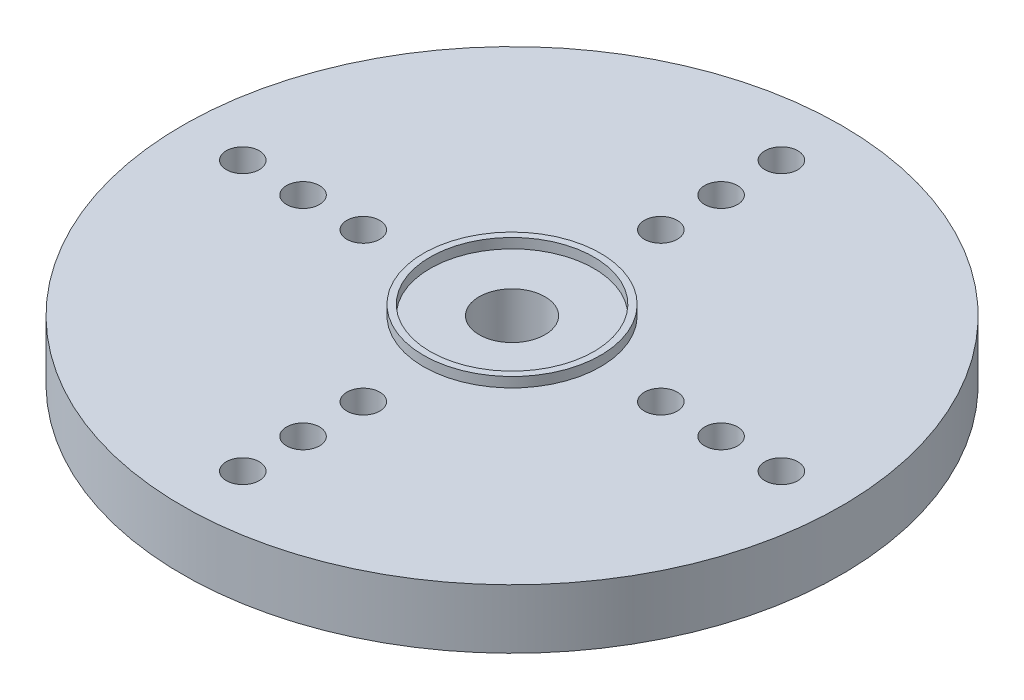
ISO-10303-21;
HEADER;
FILE_DESCRIPTION(('STEP AP214'),'2;1');
FILE_NAME('part.step','',(''),(''),'','','');
FILE_SCHEMA(('AUTOMOTIVE_DESIGN { 1 0 10303 214 1 1 1 1 }'));
ENDSEC;
DATA;
#1=APPLICATION_CONTEXT('core data for automotive mechanical design processes');
#2=APPLICATION_PROTOCOL_DEFINITION('international standard','automotive_design',2000,#1);
#3=PRODUCT_CONTEXT('',#1,'mechanical');
#4=PRODUCT('Part','Part','',(#3));
#5=PRODUCT_RELATED_PRODUCT_CATEGORY('part','',(#4));
#6=PRODUCT_DEFINITION_FORMATION('','',#4);
#7=PRODUCT_DEFINITION_CONTEXT('part definition',#1,'design');
#8=PRODUCT_DEFINITION('design','',#6,#7);
#9=PRODUCT_DEFINITION_SHAPE('','',#8);
#10=(LENGTH_UNIT() NAMED_UNIT(*) SI_UNIT(.MILLI.,.METRE.));
#11=(NAMED_UNIT(*) PLANE_ANGLE_UNIT() SI_UNIT($,.RADIAN.));
#12=(NAMED_UNIT(*) SI_UNIT($,.STERADIAN.) SOLID_ANGLE_UNIT());
#13=UNCERTAINTY_MEASURE_WITH_UNIT(LENGTH_MEASURE(1.E-05),#10,'distance_accuracy_value','');
#14=(GEOMETRIC_REPRESENTATION_CONTEXT(3) GLOBAL_UNCERTAINTY_ASSIGNED_CONTEXT((#13)) GLOBAL_UNIT_ASSIGNED_CONTEXT((#10,
#11,#12)) REPRESENTATION_CONTEXT('',''));
#15=CARTESIAN_POINT('',(0.,0.,0.));
#16=DIRECTION('',(0.,0.,1.));
#17=DIRECTION('',(1.,0.,0.));
#18=AXIS2_PLACEMENT_3D('',#15,#16,#17);
#19=CARTESIAN_POINT('',(1.,4.06,0.));
#20=DIRECTION('',(0.,1.,0.));
#21=DIRECTION('',(0.,0.,1.));
#22=AXIS2_PLACEMENT_3D('',#19,#20,#21);
#23=PLANE('',#22);
#24=CARTESIAN_POINT('',(0.,4.06,0.));
#25=DIRECTION('',(0.,-1.,0.));
#26=DIRECTION('',(0.,0.,-1.));
#27=AXIS2_PLACEMENT_3D('',#24,#25,#26);
#28=CIRCLE('',#27,1.);
#29=CARTESIAN_POINT('',(0.,4.06,-1.));
#30=VERTEX_POINT('',#29);
#31=EDGE_CURVE('E127',#30,#30,#28,.T.);
#32=ORIENTED_EDGE('',*,*,#31,.T.);
#33=EDGE_LOOP('',(#32));
#34=FACE_BOUND('',#33,.T.);
#35=CARTESIAN_POINT('',(0.,4.06,0.));
#36=DIRECTION('',(0.,1.,0.));
#37=DIRECTION('',(0.,0.,1.));
#38=AXIS2_PLACEMENT_3D('',#35,#36,#37);
#39=CIRCLE('',#38,2.485);
#40=CARTESIAN_POINT('',(0.,4.06,2.485));
#41=VERTEX_POINT('',#40);
#42=EDGE_CURVE('E10',#41,#41,#39,.F.);
#43=ORIENTED_EDGE('',*,*,#42,.F.);
#44=EDGE_LOOP('',(#43));
#45=FACE_BOUND('',#44,.T.);
#46=ADVANCED_FACE('F41',(#34,#45),#23,.T.);
#47=CARTESIAN_POINT('',(6.3425,4.06,0.));
#48=DIRECTION('',(0.,1.,0.));
#49=DIRECTION('',(0.,0.,1.));
#50=AXIS2_PLACEMENT_3D('',#47,#48,#49);
#51=CIRCLE('',#50,0.500000000000001);
#52=CARTESIAN_POINT('',(6.3425,4.06,0.500000000000023));
#53=VERTEX_POINT('',#52);
#54=EDGE_CURVE('E62',#53,#53,#51,.F.);
#55=ORIENTED_EDGE('',*,*,#54,.T.);
#56=EDGE_LOOP('',(#55));
#57=FACE_BOUND('',#56,.T.);
#58=CARTESIAN_POINT('',(8.17125,4.06,0.));
#59=DIRECTION('',(0.,1.,0.));
#60=DIRECTION('',(0.,0.,1.));
#61=AXIS2_PLACEMENT_3D('',#58,#59,#60);
#62=CIRCLE('',#61,0.500000000000001);
#63=CARTESIAN_POINT('',(8.17125,4.06,0.50000000000003));
#64=VERTEX_POINT('',#63);
#65=EDGE_CURVE('E100',#64,#64,#62,.F.);
#66=ORIENTED_EDGE('',*,*,#65,.T.);
#67=EDGE_LOOP('',(#66));
#68=FACE_BOUND('',#67,.T.);
#69=CARTESIAN_POINT('',(0.,4.06,4.51375));
#70=DIRECTION('',(0.,1.,0.));
#71=DIRECTION('',(0.,0.,1.));
#72=AXIS2_PLACEMENT_3D('',#69,#70,#71);
#73=CIRCLE('',#72,0.500000000000001);
#74=CARTESIAN_POINT('',(0.,4.06,5.01375));
#75=VERTEX_POINT('',#74);
#76=EDGE_CURVE('E97',#75,#75,#73,.F.);
#77=ORIENTED_EDGE('',*,*,#76,.T.);
#78=EDGE_LOOP('',(#77));
#79=FACE_BOUND('',#78,.T.);
#80=CARTESIAN_POINT('',(0.,4.06,6.3425));
#81=DIRECTION('',(0.,1.,0.));
#82=DIRECTION('',(0.,0.,1.));
#83=AXIS2_PLACEMENT_3D('',#80,#81,#82);
#84=CIRCLE('',#83,0.500000000000001);
#85=CARTESIAN_POINT('',(0.,4.06,6.8425));
#86=VERTEX_POINT('',#85);
#87=EDGE_CURVE('E94',#86,#86,#84,.F.);
#88=ORIENTED_EDGE('',*,*,#87,.T.);
#89=EDGE_LOOP('',(#88));
#90=FACE_BOUND('',#89,.T.);
#91=CARTESIAN_POINT('',(0.,4.06,8.17125));
#92=DIRECTION('',(0.,1.,0.));
#93=DIRECTION('',(0.,0.,1.));
#94=AXIS2_PLACEMENT_3D('',#91,#92,#93);
#95=CIRCLE('',#94,0.500000000000001);
#96=CARTESIAN_POINT('',(0.,4.06,8.67125));
#97=VERTEX_POINT('',#96);
#98=EDGE_CURVE('E90',#97,#97,#95,.F.);
#99=ORIENTED_EDGE('',*,*,#98,.T.);
#100=EDGE_LOOP('',(#99));
#101=FACE_BOUND('',#100,.T.);
#102=CARTESIAN_POINT('',(-4.51375,4.06,0.));
#103=DIRECTION('',(0.,1.,0.));
#104=DIRECTION('',(0.,0.,1.));
#105=AXIS2_PLACEMENT_3D('',#102,#103,#104);
#106=CIRCLE('',#105,0.500000000000001);
#107=CARTESIAN_POINT('',(-4.51375,4.06,0.499999999999953));
#108=VERTEX_POINT('',#107);
#109=EDGE_CURVE('E86',#108,#108,#106,.F.);
#110=ORIENTED_EDGE('',*,*,#109,.T.);
#111=EDGE_LOOP('',(#110));
#112=FACE_BOUND('',#111,.T.);
#113=CARTESIAN_POINT('',(-6.3425,4.06,0.));
#114=DIRECTION('',(0.,1.,0.));
#115=DIRECTION('',(0.,0.,1.));
#116=AXIS2_PLACEMENT_3D('',#113,#114,#115);
#117=CIRCLE('',#116,0.500000000000001);
#118=CARTESIAN_POINT('',(-6.3425,4.06,0.499999999999934));
#119=VERTEX_POINT('',#118);
#120=EDGE_CURVE('E82',#119,#119,#117,.F.);
#121=ORIENTED_EDGE('',*,*,#120,.T.);
#122=EDGE_LOOP('',(#121));
#123=FACE_BOUND('',#122,.T.);
#124=CARTESIAN_POINT('',(-8.17125,4.06,0.));
#125=DIRECTION('',(0.,1.,0.));
#126=DIRECTION('',(0.,0.,1.));
#127=AXIS2_PLACEMENT_3D('',#124,#125,#126);
#128=CIRCLE('',#127,0.500000000000001);
#129=CARTESIAN_POINT('',(-8.17125,4.06,0.499999999999915));
#130=VERTEX_POINT('',#129);
#131=EDGE_CURVE('E78',#130,#130,#128,.F.);
#132=ORIENTED_EDGE('',*,*,#131,.T.);
#133=EDGE_LOOP('',(#132));
#134=FACE_BOUND('',#133,.T.);
#135=CARTESIAN_POINT('',(4.51375,4.06,0.));
#136=DIRECTION('',(0.,1.,0.));
#137=DIRECTION('',(0.,0.,1.));
#138=AXIS2_PLACEMENT_3D('',#135,#136,#137);
#139=CIRCLE('',#138,0.500000000000001);
#140=CARTESIAN_POINT('',(4.51375,4.06,0.500000000000016));
#141=VERTEX_POINT('',#140);
#142=EDGE_CURVE('E74',#141,#141,#139,.F.);
#143=ORIENTED_EDGE('',*,*,#142,.T.);
#144=EDGE_LOOP('',(#143));
#145=FACE_BOUND('',#144,.T.);
#146=CARTESIAN_POINT('',(0.,4.06,-4.51375));
#147=DIRECTION('',(0.,1.,0.));
#148=DIRECTION('',(0.,0.,1.));
#149=AXIS2_PLACEMENT_3D('',#146,#147,#148);
#150=CIRCLE('',#149,0.500000000000001);
#151=CARTESIAN_POINT('',(0.,4.06,-4.01375));
#152=VERTEX_POINT('',#151);
#153=EDGE_CURVE('E70',#152,#152,#150,.F.);
#154=ORIENTED_EDGE('',*,*,#153,.T.);
#155=EDGE_LOOP('',(#154));
#156=FACE_BOUND('',#155,.T.);
#157=CARTESIAN_POINT('',(0.,4.06,-6.3425));
#158=DIRECTION('',(0.,1.,0.));
#159=DIRECTION('',(0.,0.,1.));
#160=AXIS2_PLACEMENT_3D('',#157,#158,#159);
#161=CIRCLE('',#160,0.500000000000001);
#162=CARTESIAN_POINT('',(0.,4.06,-5.8425));
#163=VERTEX_POINT('',#162);
#164=EDGE_CURVE('E66',#163,#163,#161,.F.);
#165=ORIENTED_EDGE('',*,*,#164,.T.);
#166=EDGE_LOOP('',(#165));
#167=FACE_BOUND('',#166,.T.);
#168=CARTESIAN_POINT('',(0.,4.06,-8.17125));
#169=DIRECTION('',(0.,1.,0.));
#170=DIRECTION('',(0.,0.,1.));
#171=AXIS2_PLACEMENT_3D('',#168,#169,#170);
#172=CIRCLE('',#171,0.500000000000001);
#173=CARTESIAN_POINT('',(0.,4.06,-7.67125));
#174=VERTEX_POINT('',#173);
#175=EDGE_CURVE('E61',#174,#174,#172,.F.);
#176=ORIENTED_EDGE('',*,*,#175,.T.);
#177=EDGE_LOOP('',(#176));
#178=FACE_BOUND('',#177,.T.);
#179=CARTESIAN_POINT('',(0.,4.06,0.));
#180=DIRECTION('',(0.,1.,0.));
#181=DIRECTION('',(0.,0.,1.));
#182=AXIS2_PLACEMENT_3D('',#179,#180,#181);
#183=CIRCLE('',#182,2.685);
#184=CARTESIAN_POINT('',(0.,4.06,2.685));
#185=VERTEX_POINT('',#184);
#186=EDGE_CURVE('E123',#185,#185,#183,.T.);
#187=ORIENTED_EDGE('',*,*,#186,.F.);
#188=EDGE_LOOP('',(#187));
#189=FACE_BOUND('',#188,.T.);
#190=CARTESIAN_POINT('',(0.,4.06,0.));
#191=DIRECTION('',(0.,-1.,0.));
#192=DIRECTION('',(0.,0.,-1.));
#193=AXIS2_PLACEMENT_3D('',#190,#191,#192);
#194=CIRCLE('',#193,10.);
#195=CARTESIAN_POINT('',(0.,4.06,-10.));
#196=VERTEX_POINT('',#195);
#197=EDGE_CURVE('E49',#196,#196,#194,.T.);
#198=ORIENTED_EDGE('',*,*,#197,.F.);
#199=EDGE_LOOP('',(#198));
#200=FACE_BOUND('',#199,.T.);
#201=ADVANCED_FACE('F43',(#57,#68,#79,#90,#101,#112,#123,#134,#145,#156,#167,#178,#189,#200),
#23,.T.);
#202=CARTESIAN_POINT('',(0.,0.,0.));
#203=DIRECTION('',(0.,-1.,0.));
#204=DIRECTION('',(0.,0.,-1.));
#205=AXIS2_PLACEMENT_3D('',#202,#203,#204);
#206=CYLINDRICAL_SURFACE('',#205,10.);
#207=ORIENTED_EDGE('',*,*,#197,.T.);
#208=EDGE_LOOP('',(#207));
#209=FACE_BOUND('',#208,.T.);
#210=CARTESIAN_POINT('',(0.,2.26,0.));
#211=DIRECTION('',(0.,-1.,0.));
#212=DIRECTION('',(0.,0.,-1.));
#213=AXIS2_PLACEMENT_3D('',#210,#211,#212);
#214=CIRCLE('',#213,10.);
#215=CARTESIAN_POINT('',(0.,2.26,-10.));
#216=VERTEX_POINT('',#215);
#217=EDGE_CURVE('E54',#216,#216,#214,.T.);
#218=ORIENTED_EDGE('',*,*,#217,.F.);
#219=EDGE_LOOP('',(#218));
#220=FACE_BOUND('',#219,.T.);
#221=ADVANCED_FACE('F152',(#209,#220),#206,.T.);
#222=CARTESIAN_POINT('',(10.,2.26,0.));
#223=DIRECTION('',(0.,-1.,0.));
#224=DIRECTION('',(0.,0.,-1.));
#225=AXIS2_PLACEMENT_3D('',#222,#223,#224);
#226=PLANE('',#225);
#227=CARTESIAN_POINT('',(6.3425,2.26,0.));
#228=DIRECTION('',(0.,-1.,0.));
#229=DIRECTION('',(0.,0.,-1.));
#230=AXIS2_PLACEMENT_3D('',#227,#228,#229);
#231=CIRCLE('',#230,0.500000000000001);
#232=CARTESIAN_POINT('',(6.3425,2.26,-0.499999999999979));
#233=VERTEX_POINT('',#232);
#234=EDGE_CURVE('E45',#233,#233,#231,.F.);
#235=ORIENTED_EDGE('',*,*,#234,.T.);
#236=EDGE_LOOP('',(#235));
#237=FACE_BOUND('',#236,.T.);
#238=CARTESIAN_POINT('',(8.17125,2.26,0.));
#239=DIRECTION('',(0.,-1.,0.));
#240=DIRECTION('',(0.,0.,-1.));
#241=AXIS2_PLACEMENT_3D('',#238,#239,#240);
#242=CIRCLE('',#241,0.500000000000001);
#243=CARTESIAN_POINT('',(8.17125,2.26,-0.499999999999972));
#244=VERTEX_POINT('',#243);
#245=EDGE_CURVE('E98',#244,#244,#242,.F.);
#246=ORIENTED_EDGE('',*,*,#245,.T.);
#247=EDGE_LOOP('',(#246));
#248=FACE_BOUND('',#247,.T.);
#249=CARTESIAN_POINT('',(0.,2.26,4.51375));
#250=DIRECTION('',(0.,-1.,0.));
#251=DIRECTION('',(0.,0.,-1.));
#252=AXIS2_PLACEMENT_3D('',#249,#250,#251);
#253=CIRCLE('',#252,0.500000000000001);
#254=CARTESIAN_POINT('',(0.,2.26,4.01375));
#255=VERTEX_POINT('',#254);
#256=EDGE_CURVE('E95',#255,#255,#253,.F.);
#257=ORIENTED_EDGE('',*,*,#256,.T.);
#258=EDGE_LOOP('',(#257));
#259=FACE_BOUND('',#258,.T.);
#260=CARTESIAN_POINT('',(0.,2.26,6.3425));
#261=DIRECTION('',(0.,-1.,0.));
#262=DIRECTION('',(0.,0.,-1.));
#263=AXIS2_PLACEMENT_3D('',#260,#261,#262);
#264=CIRCLE('',#263,0.500000000000001);
#265=CARTESIAN_POINT('',(0.,2.26,5.8425));
#266=VERTEX_POINT('',#265);
#267=EDGE_CURVE('E91',#266,#266,#264,.F.);
#268=ORIENTED_EDGE('',*,*,#267,.T.);
#269=EDGE_LOOP('',(#268));
#270=FACE_BOUND('',#269,.T.);
#271=CARTESIAN_POINT('',(0.,2.26,8.17125));
#272=DIRECTION('',(0.,-1.,0.));
#273=DIRECTION('',(0.,0.,-1.));
#274=AXIS2_PLACEMENT_3D('',#271,#272,#273);
#275=CIRCLE('',#274,0.500000000000001);
#276=CARTESIAN_POINT('',(0.,2.26,7.67125));
#277=VERTEX_POINT('',#276);
#278=EDGE_CURVE('E87',#277,#277,#275,.F.);
#279=ORIENTED_EDGE('',*,*,#278,.T.);
#280=EDGE_LOOP('',(#279));
#281=FACE_BOUND('',#280,.T.);
#282=CARTESIAN_POINT('',(-4.51375,2.26,0.));
#283=DIRECTION('',(0.,-1.,0.));
#284=DIRECTION('',(0.,0.,-1.));
#285=AXIS2_PLACEMENT_3D('',#282,#283,#284);
#286=CIRCLE('',#285,0.500000000000001);
#287=CARTESIAN_POINT('',(-4.51375,2.26,-0.500000000000048));
#288=VERTEX_POINT('',#287);
#289=EDGE_CURVE('E83',#288,#288,#286,.F.);
#290=ORIENTED_EDGE('',*,*,#289,.T.);
#291=EDGE_LOOP('',(#290));
#292=FACE_BOUND('',#291,.T.);
#293=CARTESIAN_POINT('',(-6.3425,2.26,0.));
#294=DIRECTION('',(0.,-1.,0.));
#295=DIRECTION('',(0.,0.,-1.));
#296=AXIS2_PLACEMENT_3D('',#293,#294,#295);
#297=CIRCLE('',#296,0.500000000000001);
#298=CARTESIAN_POINT('',(-6.3425,2.26,-0.500000000000067));
#299=VERTEX_POINT('',#298);
#300=EDGE_CURVE('E79',#299,#299,#297,.F.);
#301=ORIENTED_EDGE('',*,*,#300,.T.);
#302=EDGE_LOOP('',(#301));
#303=FACE_BOUND('',#302,.T.);
#304=CARTESIAN_POINT('',(-8.17125,2.26,0.));
#305=DIRECTION('',(0.,-1.,0.));
#306=DIRECTION('',(0.,0.,-1.));
#307=AXIS2_PLACEMENT_3D('',#304,#305,#306);
#308=CIRCLE('',#307,0.500000000000001);
#309=CARTESIAN_POINT('',(-8.17125,2.26,-0.500000000000086));
#310=VERTEX_POINT('',#309);
#311=EDGE_CURVE('E75',#310,#310,#308,.F.);
#312=ORIENTED_EDGE('',*,*,#311,.T.);
#313=EDGE_LOOP('',(#312));
#314=FACE_BOUND('',#313,.T.);
#315=CARTESIAN_POINT('',(4.51375,2.26,0.));
#316=DIRECTION('',(0.,-1.,0.));
#317=DIRECTION('',(0.,0.,-1.));
#318=AXIS2_PLACEMENT_3D('',#315,#316,#317);
#319=CIRCLE('',#318,0.500000000000001);
#320=CARTESIAN_POINT('',(4.51375,2.26,-0.499999999999985));
#321=VERTEX_POINT('',#320);
#322=EDGE_CURVE('E71',#321,#321,#319,.F.);
#323=ORIENTED_EDGE('',*,*,#322,.T.);
#324=EDGE_LOOP('',(#323));
#325=FACE_BOUND('',#324,.T.);
#326=CARTESIAN_POINT('',(0.,2.26,-4.51375));
#327=DIRECTION('',(0.,-1.,0.));
#328=DIRECTION('',(0.,0.,-1.));
#329=AXIS2_PLACEMENT_3D('',#326,#327,#328);
#330=CIRCLE('',#329,0.500000000000001);
#331=CARTESIAN_POINT('',(0.,2.26,-5.01375));
#332=VERTEX_POINT('',#331);
#333=EDGE_CURVE('E67',#332,#332,#330,.F.);
#334=ORIENTED_EDGE('',*,*,#333,.T.);
#335=EDGE_LOOP('',(#334));
#336=FACE_BOUND('',#335,.T.);
#337=CARTESIAN_POINT('',(0.,2.26,-6.3425));
#338=DIRECTION('',(0.,-1.,0.));
#339=DIRECTION('',(0.,0.,-1.));
#340=AXIS2_PLACEMENT_3D('',#337,#338,#339);
#341=CIRCLE('',#340,0.500000000000001);
#342=CARTESIAN_POINT('',(0.,2.26,-6.8425));
#343=VERTEX_POINT('',#342);
#344=EDGE_CURVE('E63',#343,#343,#341,.F.);
#345=ORIENTED_EDGE('',*,*,#344,.T.);
#346=EDGE_LOOP('',(#345));
#347=FACE_BOUND('',#346,.T.);
#348=CARTESIAN_POINT('',(0.,2.26,-8.17125));
#349=DIRECTION('',(0.,-1.,0.));
#350=DIRECTION('',(0.,0.,-1.));
#351=AXIS2_PLACEMENT_3D('',#348,#349,#350);
#352=CIRCLE('',#351,0.500000000000001);
#353=CARTESIAN_POINT('',(0.,2.26,-8.67125));
#354=VERTEX_POINT('',#353);
#355=EDGE_CURVE('E58',#354,#354,#352,.F.);
#356=ORIENTED_EDGE('',*,*,#355,.T.);
#357=EDGE_LOOP('',(#356));
#358=FACE_BOUND('',#357,.T.);
#359=ORIENTED_EDGE('',*,*,#217,.T.);
#360=EDGE_LOOP('',(#359));
#361=FACE_BOUND('',#360,.T.);
#362=CARTESIAN_POINT('',(0.,2.26,0.));
#363=DIRECTION('',(0.,-1.,0.));
#364=DIRECTION('',(0.,0.,-1.));
#365=AXIS2_PLACEMENT_3D('',#362,#363,#364);
#366=CIRCLE('',#365,3.5);
#367=CARTESIAN_POINT('',(0.,2.26,-3.5));
#368=VERTEX_POINT('',#367);
#369=EDGE_CURVE('E144',#368,#368,#366,.T.);
#370=ORIENTED_EDGE('',*,*,#369,.F.);
#371=EDGE_LOOP('',(#370));
#372=FACE_BOUND('',#371,.T.);
#373=ADVANCED_FACE('F149',(#237,#248,#259,#270,#281,#292,#303,#314,#325,#336,#347,#358,#361,
#372),#226,.T.);
#374=CARTESIAN_POINT('',(0.,0.,0.));
#375=DIRECTION('',(0.,-1.,0.));
#376=DIRECTION('',(0.,0.,-1.));
#377=AXIS2_PLACEMENT_3D('',#374,#375,#376);
#378=CYLINDRICAL_SURFACE('',#377,3.5);
#379=ORIENTED_EDGE('',*,*,#369,.T.);
#380=EDGE_LOOP('',(#379));
#381=FACE_BOUND('',#380,.T.);
#382=CARTESIAN_POINT('',(0.,0.,0.));
#383=DIRECTION('',(0.,-1.,0.));
#384=DIRECTION('',(0.,0.,-1.));
#385=AXIS2_PLACEMENT_3D('',#382,#383,#384);
#386=CIRCLE('',#385,3.5);
#387=CARTESIAN_POINT('',(0.,0.,-3.5));
#388=VERTEX_POINT('',#387);
#389=EDGE_CURVE('E141',#388,#388,#386,.T.);
#390=ORIENTED_EDGE('',*,*,#389,.F.);
#391=EDGE_LOOP('',(#390));
#392=FACE_BOUND('',#391,.T.);
#393=ADVANCED_FACE('F159',(#381,#392),#378,.T.);
#394=CARTESIAN_POINT('',(3.5,0.,0.));
#395=DIRECTION('',(0.,-1.,0.));
#396=DIRECTION('',(0.,0.,-1.));
#397=AXIS2_PLACEMENT_3D('',#394,#395,#396);
#398=PLANE('',#397);
#399=ORIENTED_EDGE('',*,*,#389,.T.);
#400=EDGE_LOOP('',(#399));
#401=FACE_BOUND('',#400,.T.);
#402=CARTESIAN_POINT('',(0.,0.,0.));
#403=DIRECTION('',(0.,-1.,0.));
#404=DIRECTION('',(0.,0.,-1.));
#405=AXIS2_PLACEMENT_3D('',#402,#403,#404);
#406=CIRCLE('',#405,2.435);
#407=CARTESIAN_POINT('',(0.,0.,-2.435));
#408=VERTEX_POINT('',#407);
#409=EDGE_CURVE('E138',#408,#408,#406,.T.);
#410=ORIENTED_EDGE('',*,*,#409,.F.);
#411=EDGE_LOOP('',(#410));
#412=FACE_BOUND('',#411,.T.);
#413=ADVANCED_FACE('F191',(#401,#412),#398,.T.);
#414=CARTESIAN_POINT('',(0.,0.,0.));
#415=DIRECTION('',(0.,-1.,0.));
#416=DIRECTION('',(0.,0.,-1.));
#417=AXIS2_PLACEMENT_3D('',#414,#415,#416);
#418=CYLINDRICAL_SURFACE('',#417,2.435);
#419=ORIENTED_EDGE('',*,*,#409,.T.);
#420=EDGE_LOOP('',(#419));
#421=FACE_BOUND('',#420,.T.);
#422=CARTESIAN_POINT('',(0.,2.26,0.));
#423=DIRECTION('',(0.,-1.,0.));
#424=DIRECTION('',(0.,0.,-1.));
#425=AXIS2_PLACEMENT_3D('',#422,#423,#424);
#426=CIRCLE('',#425,2.435);
#427=CARTESIAN_POINT('',(0.,2.26,-2.435));
#428=VERTEX_POINT('',#427);
#429=EDGE_CURVE('E135',#428,#428,#426,.T.);
#430=ORIENTED_EDGE('',*,*,#429,.F.);
#431=EDGE_LOOP('',(#430));
#432=FACE_BOUND('',#431,.T.);
#433=ADVANCED_FACE('F184',(#421,#432),#418,.F.);
#434=CARTESIAN_POINT('',(1.,2.26,0.));
#435=DIRECTION('',(0.,-1.,0.));
#436=DIRECTION('',(0.,0.,-1.));
#437=AXIS2_PLACEMENT_3D('',#434,#435,#436);
#438=PLANE('',#437);
#439=ORIENTED_EDGE('',*,*,#429,.T.);
#440=EDGE_LOOP('',(#439));
#441=FACE_BOUND('',#440,.T.);
#442=CARTESIAN_POINT('',(0.,2.26,0.));
#443=DIRECTION('',(0.,-1.,0.));
#444=DIRECTION('',(0.,0.,-1.));
#445=AXIS2_PLACEMENT_3D('',#442,#443,#444);
#446=CIRCLE('',#445,1.);
#447=CARTESIAN_POINT('',(0.,2.26,-1.));
#448=VERTEX_POINT('',#447);
#449=EDGE_CURVE('E132',#448,#448,#446,.T.);
#450=ORIENTED_EDGE('',*,*,#449,.F.);
#451=EDGE_LOOP('',(#450));
#452=FACE_BOUND('',#451,.T.);
#453=ADVANCED_FACE('F175',(#441,#452),#438,.T.);
#454=CARTESIAN_POINT('',(0.,0.,0.));
#455=DIRECTION('',(0.,-1.,0.));
#456=DIRECTION('',(0.,0.,-1.));
#457=AXIS2_PLACEMENT_3D('',#454,#455,#456);
#458=CYLINDRICAL_SURFACE('',#457,1.);
#459=ORIENTED_EDGE('',*,*,#449,.T.);
#460=EDGE_LOOP('',(#459));
#461=FACE_BOUND('',#460,.T.);
#462=ORIENTED_EDGE('',*,*,#31,.F.);
#463=EDGE_LOOP('',(#462));
#464=FACE_BOUND('',#463,.T.);
#465=ADVANCED_FACE('F173',(#461,#464),#458,.F.);
#466=CARTESIAN_POINT('',(0.,4.36,0.));
#467=DIRECTION('',(0.,1.,0.));
#468=DIRECTION('',(0.,0.,1.));
#469=AXIS2_PLACEMENT_3D('',#466,#467,#468);
#470=PLANE('',#469);
#471=CARTESIAN_POINT('',(0.,4.36,0.));
#472=DIRECTION('',(0.,1.,0.));
#473=DIRECTION('',(0.,0.,1.));
#474=AXIS2_PLACEMENT_3D('',#471,#472,#473);
#475=CIRCLE('',#474,2.685);
#476=CARTESIAN_POINT('',(0.,4.36,2.685));
#477=VERTEX_POINT('',#476);
#478=EDGE_CURVE('E124',#477,#477,#475,.T.);
#479=ORIENTED_EDGE('',*,*,#478,.T.);
#480=EDGE_LOOP('',(#479));
#481=FACE_BOUND('',#480,.T.);
#482=CARTESIAN_POINT('',(0.,4.36,0.));
#483=DIRECTION('',(0.,1.,0.));
#484=DIRECTION('',(0.,0.,1.));
#485=AXIS2_PLACEMENT_3D('',#482,#483,#484);
#486=CIRCLE('',#485,2.485);
#487=CARTESIAN_POINT('',(0.,4.36,2.485));
#488=VERTEX_POINT('',#487);
#489=EDGE_CURVE('E120',#488,#488,#486,.T.);
#490=ORIENTED_EDGE('',*,*,#489,.F.);
#491=EDGE_LOOP('',(#490));
#492=FACE_BOUND('',#491,.T.);
#493=ADVANCED_FACE('F174',(#481,#492),#470,.T.);
#494=CARTESIAN_POINT('',(0.,4.36,0.));
#495=DIRECTION('',(0.,-1.,0.));
#496=DIRECTION('',(0.,0.,-1.));
#497=AXIS2_PLACEMENT_3D('',#494,#495,#496);
#498=CYLINDRICAL_SURFACE('',#497,2.685);
#499=ORIENTED_EDGE('',*,*,#478,.F.);
#500=EDGE_LOOP('',(#499));
#501=FACE_BOUND('',#500,.T.);
#502=ORIENTED_EDGE('',*,*,#186,.T.);
#503=EDGE_LOOP('',(#502));
#504=FACE_BOUND('',#503,.T.);
#505=ADVANCED_FACE('F181',(#501,#504),#498,.T.);
#506=CARTESIAN_POINT('',(0.,4.36,0.));
#507=DIRECTION('',(0.,-1.,0.));
#508=DIRECTION('',(0.,0.,-1.));
#509=AXIS2_PLACEMENT_3D('',#506,#507,#508);
#510=CYLINDRICAL_SURFACE('',#509,2.485);
#511=ORIENTED_EDGE('',*,*,#489,.T.);
#512=EDGE_LOOP('',(#511));
#513=FACE_BOUND('',#512,.T.);
#514=ORIENTED_EDGE('',*,*,#42,.T.);
#515=EDGE_LOOP('',(#514));
#516=FACE_BOUND('',#515,.T.);
#517=ADVANCED_FACE('F248',(#513,#516),#510,.F.);
#518=CARTESIAN_POINT('',(0.,4.36,-8.17125));
#519=DIRECTION('',(0.,-1.,0.));
#520=DIRECTION('',(0.,0.,-1.));
#521=AXIS2_PLACEMENT_3D('',#518,#519,#520);
#522=CYLINDRICAL_SURFACE('',#521,0.500000000000001);
#523=ORIENTED_EDGE('',*,*,#175,.F.);
#524=EDGE_LOOP('',(#523));
#525=FACE_BOUND('',#524,.T.);
#526=ORIENTED_EDGE('',*,*,#355,.F.);
#527=EDGE_LOOP('',(#526));
#528=FACE_BOUND('',#527,.T.);
#529=ADVANCED_FACE('F257',(#525,#528),#522,.F.);
#530=CARTESIAN_POINT('',(0.,4.36,-6.3425));
#531=DIRECTION('',(0.,-1.,0.));
#532=DIRECTION('',(0.,0.,-1.));
#533=AXIS2_PLACEMENT_3D('',#530,#531,#532);
#534=CYLINDRICAL_SURFACE('',#533,0.500000000000001);
#535=ORIENTED_EDGE('',*,*,#164,.F.);
#536=EDGE_LOOP('',(#535));
#537=FACE_BOUND('',#536,.T.);
#538=ORIENTED_EDGE('',*,*,#344,.F.);
#539=EDGE_LOOP('',(#538));
#540=FACE_BOUND('',#539,.T.);
#541=ADVANCED_FACE('F267',(#537,#540),#534,.F.);
#542=CARTESIAN_POINT('',(0.,4.36,-4.51375));
#543=DIRECTION('',(0.,-1.,0.));
#544=DIRECTION('',(0.,0.,-1.));
#545=AXIS2_PLACEMENT_3D('',#542,#543,#544);
#546=CYLINDRICAL_SURFACE('',#545,0.500000000000001);
#547=ORIENTED_EDGE('',*,*,#153,.F.);
#548=EDGE_LOOP('',(#547));
#549=FACE_BOUND('',#548,.T.);
#550=ORIENTED_EDGE('',*,*,#333,.F.);
#551=EDGE_LOOP('',(#550));
#552=FACE_BOUND('',#551,.T.);
#553=ADVANCED_FACE('F277',(#549,#552),#546,.F.);
#554=CARTESIAN_POINT('',(4.51375,4.36,0.));
#555=DIRECTION('',(0.,-1.,0.));
#556=DIRECTION('',(0.,0.,-1.));
#557=AXIS2_PLACEMENT_3D('',#554,#555,#556);
#558=CYLINDRICAL_SURFACE('',#557,0.500000000000001);
#559=ORIENTED_EDGE('',*,*,#142,.F.);
#560=EDGE_LOOP('',(#559));
#561=FACE_BOUND('',#560,.T.);
#562=ORIENTED_EDGE('',*,*,#322,.F.);
#563=EDGE_LOOP('',(#562));
#564=FACE_BOUND('',#563,.T.);
#565=ADVANCED_FACE('F287',(#561,#564),#558,.F.);
#566=CARTESIAN_POINT('',(-8.17125,4.36,0.));
#567=DIRECTION('',(0.,-1.,0.));
#568=DIRECTION('',(0.,0.,-1.));
#569=AXIS2_PLACEMENT_3D('',#566,#567,#568);
#570=CYLINDRICAL_SURFACE('',#569,0.500000000000001);
#571=ORIENTED_EDGE('',*,*,#131,.F.);
#572=EDGE_LOOP('',(#571));
#573=FACE_BOUND('',#572,.T.);
#574=ORIENTED_EDGE('',*,*,#311,.F.);
#575=EDGE_LOOP('',(#574));
#576=FACE_BOUND('',#575,.T.);
#577=ADVANCED_FACE('F297',(#573,#576),#570,.F.);
#578=CARTESIAN_POINT('',(-6.3425,4.36,0.));
#579=DIRECTION('',(0.,-1.,0.));
#580=DIRECTION('',(0.,0.,-1.));
#581=AXIS2_PLACEMENT_3D('',#578,#579,#580);
#582=CYLINDRICAL_SURFACE('',#581,0.500000000000001);
#583=ORIENTED_EDGE('',*,*,#120,.F.);
#584=EDGE_LOOP('',(#583));
#585=FACE_BOUND('',#584,.T.);
#586=ORIENTED_EDGE('',*,*,#300,.F.);
#587=EDGE_LOOP('',(#586));
#588=FACE_BOUND('',#587,.T.);
#589=ADVANCED_FACE('F307',(#585,#588),#582,.F.);
#590=CARTESIAN_POINT('',(-4.51375,4.36,0.));
#591=DIRECTION('',(0.,-1.,0.));
#592=DIRECTION('',(0.,0.,-1.));
#593=AXIS2_PLACEMENT_3D('',#590,#591,#592);
#594=CYLINDRICAL_SURFACE('',#593,0.500000000000001);
#595=ORIENTED_EDGE('',*,*,#109,.F.);
#596=EDGE_LOOP('',(#595));
#597=FACE_BOUND('',#596,.T.);
#598=ORIENTED_EDGE('',*,*,#289,.F.);
#599=EDGE_LOOP('',(#598));
#600=FACE_BOUND('',#599,.T.);
#601=ADVANCED_FACE('F317',(#597,#600),#594,.F.);
#602=CARTESIAN_POINT('',(0.,4.36,8.17125));
#603=DIRECTION('',(0.,-1.,0.));
#604=DIRECTION('',(0.,0.,-1.));
#605=AXIS2_PLACEMENT_3D('',#602,#603,#604);
#606=CYLINDRICAL_SURFACE('',#605,0.500000000000001);
#607=ORIENTED_EDGE('',*,*,#98,.F.);
#608=EDGE_LOOP('',(#607));
#609=FACE_BOUND('',#608,.T.);
#610=ORIENTED_EDGE('',*,*,#278,.F.);
#611=EDGE_LOOP('',(#610));
#612=FACE_BOUND('',#611,.T.);
#613=ADVANCED_FACE('F327',(#609,#612),#606,.F.);
#614=CARTESIAN_POINT('',(0.,4.36,6.3425));
#615=DIRECTION('',(0.,-1.,0.));
#616=DIRECTION('',(0.,0.,-1.));
#617=AXIS2_PLACEMENT_3D('',#614,#615,#616);
#618=CYLINDRICAL_SURFACE('',#617,0.500000000000001);
#619=ORIENTED_EDGE('',*,*,#87,.F.);
#620=EDGE_LOOP('',(#619));
#621=FACE_BOUND('',#620,.T.);
#622=ORIENTED_EDGE('',*,*,#267,.F.);
#623=EDGE_LOOP('',(#622));
#624=FACE_BOUND('',#623,.T.);
#625=ADVANCED_FACE('F337',(#621,#624),#618,.F.);
#626=CARTESIAN_POINT('',(0.,4.36,4.51375));
#627=DIRECTION('',(0.,-1.,0.));
#628=DIRECTION('',(0.,0.,-1.));
#629=AXIS2_PLACEMENT_3D('',#626,#627,#628);
#630=CYLINDRICAL_SURFACE('',#629,0.500000000000001);
#631=ORIENTED_EDGE('',*,*,#76,.F.);
#632=EDGE_LOOP('',(#631));
#633=FACE_BOUND('',#632,.T.);
#634=ORIENTED_EDGE('',*,*,#256,.F.);
#635=EDGE_LOOP('',(#634));
#636=FACE_BOUND('',#635,.T.);
#637=ADVANCED_FACE('F347',(#633,#636),#630,.F.);
#638=CARTESIAN_POINT('',(8.17125,4.36,0.));
#639=DIRECTION('',(0.,-1.,0.));
#640=DIRECTION('',(0.,0.,-1.));
#641=AXIS2_PLACEMENT_3D('',#638,#639,#640);
#642=CYLINDRICAL_SURFACE('',#641,0.500000000000001);
#643=ORIENTED_EDGE('',*,*,#65,.F.);
#644=EDGE_LOOP('',(#643));
#645=FACE_BOUND('',#644,.T.);
#646=ORIENTED_EDGE('',*,*,#245,.F.);
#647=EDGE_LOOP('',(#646));
#648=FACE_BOUND('',#647,.T.);
#649=ADVANCED_FACE('F357',(#645,#648),#642,.F.);
#650=CARTESIAN_POINT('',(6.3425,4.36,0.));
#651=DIRECTION('',(0.,-1.,0.));
#652=DIRECTION('',(0.,0.,-1.));
#653=AXIS2_PLACEMENT_3D('',#650,#651,#652);
#654=CYLINDRICAL_SURFACE('',#653,0.500000000000001);
#655=ORIENTED_EDGE('',*,*,#54,.F.);
#656=EDGE_LOOP('',(#655));
#657=FACE_BOUND('',#656,.T.);
#658=ORIENTED_EDGE('',*,*,#234,.F.);
#659=EDGE_LOOP('',(#658));
#660=FACE_BOUND('',#659,.T.);
#661=ADVANCED_FACE('F367',(#657,#660),#654,.F.);
#662=CLOSED_SHELL('',(#46,#201,#221,#373,#393,#413,#433,#453,#465,#493,#505,#517,#529,#541,#553,
#565,#577,#589,#601,#613,#625,#637,#649,#661));
#663=MANIFOLD_SOLID_BREP('B2',#662);
#664=ADVANCED_BREP_SHAPE_REPRESENTATION('',(#18,#663),#14);
#665=SHAPE_DEFINITION_REPRESENTATION(#9,#664);
ENDSEC;
END-ISO-10303-21;
